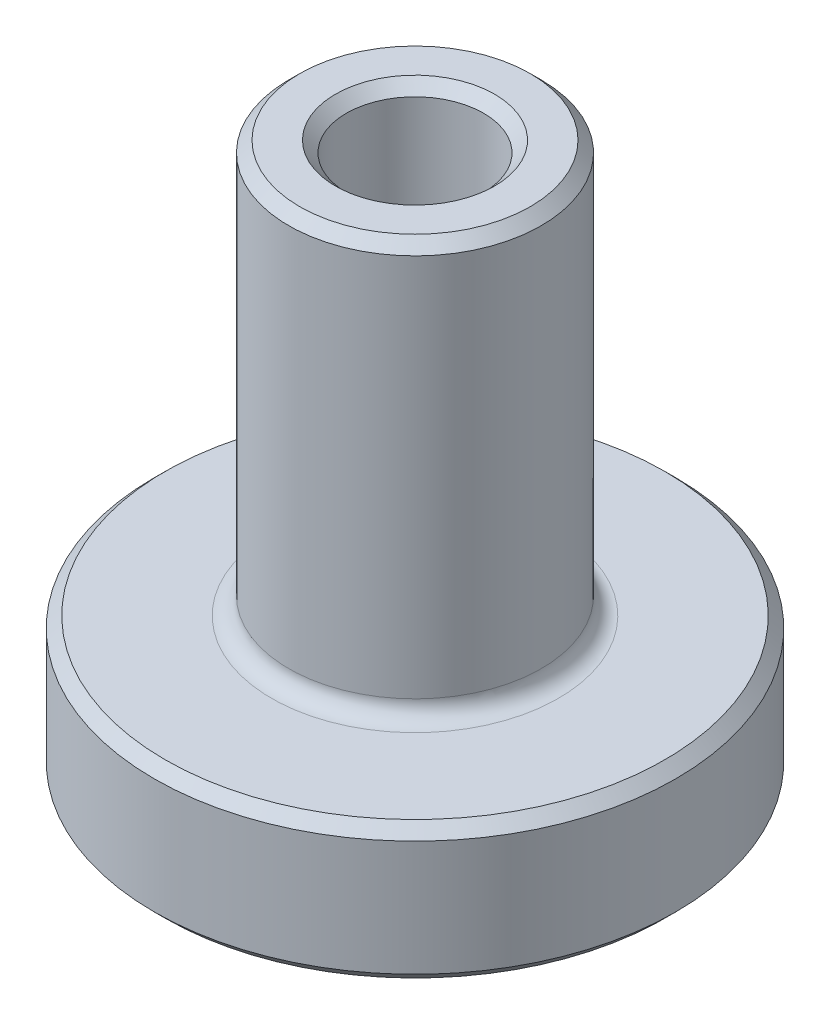
ISO-10303-21;
HEADER;
FILE_DESCRIPTION(('STEP AP214'),'2;1');
FILE_NAME('part.step','',(''),(''),'','','');
FILE_SCHEMA(('AUTOMOTIVE_DESIGN { 1 0 10303 214 1 1 1 1 }'));
ENDSEC;
DATA;
#1=APPLICATION_CONTEXT('core data for automotive mechanical design processes');
#2=APPLICATION_PROTOCOL_DEFINITION('international standard','automotive_design',2000,#1);
#3=PRODUCT_CONTEXT('',#1,'mechanical');
#4=PRODUCT('Part','Part','',(#3));
#5=PRODUCT_RELATED_PRODUCT_CATEGORY('part','',(#4));
#6=PRODUCT_DEFINITION_FORMATION('','',#4);
#7=PRODUCT_DEFINITION_CONTEXT('part definition',#1,'design');
#8=PRODUCT_DEFINITION('design','',#6,#7);
#9=PRODUCT_DEFINITION_SHAPE('','',#8);
#10=(LENGTH_UNIT() NAMED_UNIT(*) SI_UNIT(.MILLI.,.METRE.));
#11=(NAMED_UNIT(*) PLANE_ANGLE_UNIT() SI_UNIT($,.RADIAN.));
#12=(NAMED_UNIT(*) SI_UNIT($,.STERADIAN.) SOLID_ANGLE_UNIT());
#13=UNCERTAINTY_MEASURE_WITH_UNIT(LENGTH_MEASURE(1.E-05),#10,'distance_accuracy_value','');
#14=(GEOMETRIC_REPRESENTATION_CONTEXT(3) GLOBAL_UNCERTAINTY_ASSIGNED_CONTEXT((#13)) GLOBAL_UNIT_ASSIGNED_CONTEXT((#10,
#11,#12)) REPRESENTATION_CONTEXT('',''));
#15=CARTESIAN_POINT('',(0.,0.,0.));
#16=DIRECTION('',(0.,0.,1.));
#17=DIRECTION('',(1.,0.,0.));
#18=AXIS2_PLACEMENT_3D('',#15,#16,#17);
#19=CARTESIAN_POINT('',(0.,7.88649990336381,0.));
#20=DIRECTION('',(0.,1.,0.));
#21=DIRECTION('',(0.,0.,1.));
#22=AXIS2_PLACEMENT_3D('',#19,#20,#21);
#23=CYLINDRICAL_SURFACE('',#22,1.5875);
#24=CARTESIAN_POINT('',(0.,12.446,0.));
#25=DIRECTION('',(0.,-1.,0.));
#26=DIRECTION('',(0.,0.,-1.));
#27=AXIS2_PLACEMENT_3D('',#24,#25,#26);
#28=CIRCLE('',#27,1.5875);
#29=CARTESIAN_POINT('',(0.,12.446,-1.5875));
#30=VERTEX_POINT('',#29);
#31=EDGE_CURVE('E45',#30,#30,#28,.F.);
#32=ORIENTED_EDGE('',*,*,#31,.T.);
#33=EDGE_LOOP('',(#32));
#34=FACE_BOUND('',#33,.T.);
#35=CARTESIAN_POINT('',(0.,0.254000000000006,0.));
#36=DIRECTION('',(0.,1.,0.));
#37=DIRECTION('',(0.,0.,1.));
#38=AXIS2_PLACEMENT_3D('',#35,#36,#37);
#39=CIRCLE('',#38,1.5875);
#40=CARTESIAN_POINT('',(0.,0.254000000000006,1.5875));
#41=VERTEX_POINT('',#40);
#42=EDGE_CURVE('E50',#41,#41,#39,.F.);
#43=ORIENTED_EDGE('',*,*,#42,.T.);
#44=EDGE_LOOP('',(#43));
#45=FACE_BOUND('',#44,.T.);
#46=ADVANCED_FACE('F30',(#34,#45),#23,.F.);
#47=CARTESIAN_POINT('',(1.5875,0.,0.));
#48=DIRECTION('',(0.,1.,0.));
#49=DIRECTION('',(0.,0.,1.));
#50=AXIS2_PLACEMENT_3D('',#47,#48,#49);
#51=PLANE('',#50);
#52=CARTESIAN_POINT('',(0.,0.,0.));
#53=DIRECTION('',(0.,1.,0.));
#54=DIRECTION('',(0.,0.,1.));
#55=AXIS2_PLACEMENT_3D('',#52,#53,#54);
#56=CIRCLE('',#55,5.77849999999999);
#57=CARTESIAN_POINT('',(0.,0.,5.77849999999999));
#58=VERTEX_POINT('',#57);
#59=EDGE_CURVE('E56',#58,#58,#56,.F.);
#60=ORIENTED_EDGE('',*,*,#59,.T.);
#61=EDGE_LOOP('',(#60));
#62=FACE_BOUND('',#61,.T.);
#63=CARTESIAN_POINT('',(0.,0.,0.));
#64=DIRECTION('',(0.,1.,0.));
#65=DIRECTION('',(0.,0.,1.));
#66=AXIS2_PLACEMENT_3D('',#63,#64,#65);
#67=CIRCLE('',#66,1.8415);
#68=CARTESIAN_POINT('',(0.,0.,1.8415));
#69=VERTEX_POINT('',#68);
#70=EDGE_CURVE('E59',#69,#69,#67,.T.);
#71=ORIENTED_EDGE('',*,*,#70,.T.);
#72=EDGE_LOOP('',(#71));
#73=FACE_BOUND('',#72,.T.);
#74=ADVANCED_FACE('F94',(#62,#73),#51,.F.);
#75=CARTESIAN_POINT('',(0.,7.88649990336381,0.));
#76=DIRECTION('',(0.,1.,0.));
#77=DIRECTION('',(0.,0.,1.));
#78=AXIS2_PLACEMENT_3D('',#75,#76,#77);
#79=CYLINDRICAL_SURFACE('',#78,6.0325);
#80=CARTESIAN_POINT('',(0.,0.254000000000006,0.));
#81=DIRECTION('',(0.,1.,0.));
#82=DIRECTION('',(0.,0.,1.));
#83=AXIS2_PLACEMENT_3D('',#80,#81,#82);
#84=CIRCLE('',#83,6.0325);
#85=CARTESIAN_POINT('',(0.,0.254000000000006,6.0325));
#86=VERTEX_POINT('',#85);
#87=EDGE_CURVE('E62',#86,#86,#84,.T.);
#88=ORIENTED_EDGE('',*,*,#87,.T.);
#89=EDGE_LOOP('',(#88));
#90=FACE_BOUND('',#89,.T.);
#91=CARTESIAN_POINT('',(0.,2.921,0.));
#92=DIRECTION('',(0.,-1.,0.));
#93=DIRECTION('',(0.,0.,-1.));
#94=AXIS2_PLACEMENT_3D('',#91,#92,#93);
#95=CIRCLE('',#94,6.0325);
#96=CARTESIAN_POINT('',(0.,2.921,-6.0325));
#97=VERTEX_POINT('',#96);
#98=EDGE_CURVE('E65',#97,#97,#95,.T.);
#99=ORIENTED_EDGE('',*,*,#98,.T.);
#100=EDGE_LOOP('',(#99));
#101=FACE_BOUND('',#100,.T.);
#102=ADVANCED_FACE('F99',(#90,#101),#79,.T.);
#103=CARTESIAN_POINT('',(6.0325,3.175,0.));
#104=DIRECTION('',(0.,-1.,0.));
#105=DIRECTION('',(0.,0.,-1.));
#106=AXIS2_PLACEMENT_3D('',#103,#104,#105);
#107=PLANE('',#106);
#108=CARTESIAN_POINT('',(0.,3.175,0.));
#109=DIRECTION('',(0.,-1.,0.));
#110=DIRECTION('',(0.,0.,-1.));
#111=AXIS2_PLACEMENT_3D('',#108,#109,#110);
#112=CIRCLE('',#111,5.7785);
#113=CARTESIAN_POINT('',(0.,3.175,-5.7785));
#114=VERTEX_POINT('',#113);
#115=EDGE_CURVE('E53',#114,#114,#112,.F.);
#116=ORIENTED_EDGE('',*,*,#115,.T.);
#117=EDGE_LOOP('',(#116));
#118=FACE_BOUND('',#117,.T.);
#119=CARTESIAN_POINT('',(0.,3.175,0.));
#120=DIRECTION('',(0.,-1.,0.));
#121=DIRECTION('',(0.,0.,-1.));
#122=AXIS2_PLACEMENT_3D('',#119,#120,#121);
#123=CIRCLE('',#122,3.317875);
#124=CARTESIAN_POINT('',(0.,3.175,-3.317875));
#125=VERTEX_POINT('',#124);
#126=EDGE_CURVE('E68',#125,#125,#123,.T.);
#127=ORIENTED_EDGE('',*,*,#126,.T.);
#128=EDGE_LOOP('',(#127));
#129=FACE_BOUND('',#128,.T.);
#130=ADVANCED_FACE('F106',(#118,#129),#107,.F.);
#131=CARTESIAN_POINT('',(0.,7.88649990336381,0.));
#132=DIRECTION('',(0.,1.,0.));
#133=DIRECTION('',(0.,0.,1.));
#134=AXIS2_PLACEMENT_3D('',#131,#132,#133);
#135=CYLINDRICAL_SURFACE('',#134,2.921);
#136=CARTESIAN_POINT('',(0.,12.446,0.));
#137=DIRECTION('',(0.,-1.,0.));
#138=DIRECTION('',(0.,0.,-1.));
#139=AXIS2_PLACEMENT_3D('',#136,#137,#138);
#140=CIRCLE('',#139,2.921);
#141=CARTESIAN_POINT('',(0.,12.446,-2.921));
#142=VERTEX_POINT('',#141);
#143=EDGE_CURVE('E10',#142,#142,#140,.T.);
#144=ORIENTED_EDGE('',*,*,#143,.T.);
#145=EDGE_LOOP('',(#144));
#146=FACE_BOUND('',#145,.T.);
#147=CARTESIAN_POINT('',(0.,3.571875,0.));
#148=DIRECTION('',(0.,-1.,0.));
#149=DIRECTION('',(0.,0.,-1.));
#150=AXIS2_PLACEMENT_3D('',#147,#148,#149);
#151=CIRCLE('',#150,2.921);
#152=CARTESIAN_POINT('',(0.,3.571875,-2.921));
#153=VERTEX_POINT('',#152);
#154=EDGE_CURVE('E71',#153,#153,#151,.F.);
#155=ORIENTED_EDGE('',*,*,#154,.T.);
#156=EDGE_LOOP('',(#155));
#157=FACE_BOUND('',#156,.T.);
#158=ADVANCED_FACE('F75',(#146,#157),#135,.T.);
#159=CARTESIAN_POINT('',(2.921,12.7,0.));
#160=DIRECTION('',(0.,-1.,0.));
#161=DIRECTION('',(0.,0.,-1.));
#162=AXIS2_PLACEMENT_3D('',#159,#160,#161);
#163=PLANE('',#162);
#164=CARTESIAN_POINT('',(0.,12.7,0.));
#165=DIRECTION('',(0.,-1.,0.));
#166=DIRECTION('',(0.,0.,-1.));
#167=AXIS2_PLACEMENT_3D('',#164,#165,#166);
#168=CIRCLE('',#167,1.8415);
#169=CARTESIAN_POINT('',(0.,12.7,-1.8415));
#170=VERTEX_POINT('',#169);
#171=EDGE_CURVE('E37',#170,#170,#168,.T.);
#172=ORIENTED_EDGE('',*,*,#171,.T.);
#173=EDGE_LOOP('',(#172));
#174=FACE_BOUND('',#173,.T.);
#175=CARTESIAN_POINT('',(0.,12.7,0.));
#176=DIRECTION('',(0.,-1.,0.));
#177=DIRECTION('',(0.,0.,-1.));
#178=AXIS2_PLACEMENT_3D('',#175,#176,#177);
#179=CIRCLE('',#178,2.667);
#180=CARTESIAN_POINT('',(0.,12.7,-2.667));
#181=VERTEX_POINT('',#180);
#182=EDGE_CURVE('E41',#181,#181,#179,.F.);
#183=ORIENTED_EDGE('',*,*,#182,.T.);
#184=EDGE_LOOP('',(#183));
#185=FACE_BOUND('',#184,.T.);
#186=ADVANCED_FACE('F80',(#174,#185),#163,.F.);
#187=CARTESIAN_POINT('',(0.,3.571875,0.));
#188=DIRECTION('',(0.,-1.,0.));
#189=DIRECTION('',(0.,0.,-1.));
#190=AXIS2_PLACEMENT_3D('',#187,#188,#189);
#191=TOROIDAL_SURFACE('',#190,3.317875,0.396875);
#192=ORIENTED_EDGE('',*,*,#126,.F.);
#193=EDGE_LOOP('',(#192));
#194=FACE_BOUND('',#193,.T.);
#195=ORIENTED_EDGE('',*,*,#154,.F.);
#196=EDGE_LOOP('',(#195));
#197=FACE_BOUND('',#196,.T.);
#198=ADVANCED_FACE('F77',(#194,#197),#191,.F.);
#199=CARTESIAN_POINT('',(0.,0.254000000000006,0.));
#200=DIRECTION('',(0.,1.,0.));
#201=DIRECTION('',(0.,0.,1.));
#202=AXIS2_PLACEMENT_3D('',#199,#200,#201);
#203=CONICAL_SURFACE('',#202,6.0325,0.785398163397452);
#204=ORIENTED_EDGE('',*,*,#59,.F.);
#205=EDGE_LOOP('',(#204));
#206=FACE_BOUND('',#205,.T.);
#207=ORIENTED_EDGE('',*,*,#87,.F.);
#208=EDGE_LOOP('',(#207));
#209=FACE_BOUND('',#208,.T.);
#210=ADVANCED_FACE('F79',(#206,#209),#203,.T.);
#211=CARTESIAN_POINT('',(0.,3.175,0.));
#212=DIRECTION('',(0.,-1.,0.));
#213=DIRECTION('',(0.,0.,-1.));
#214=AXIS2_PLACEMENT_3D('',#211,#212,#213);
#215=CONICAL_SURFACE('',#214,5.7785,0.785398163397445);
#216=ORIENTED_EDGE('',*,*,#98,.F.);
#217=EDGE_LOOP('',(#216));
#218=FACE_BOUND('',#217,.T.);
#219=ORIENTED_EDGE('',*,*,#115,.F.);
#220=EDGE_LOOP('',(#219));
#221=FACE_BOUND('',#220,.T.);
#222=ADVANCED_FACE('F87',(#218,#221),#215,.T.);
#223=CARTESIAN_POINT('',(0.,12.446,0.));
#224=DIRECTION('',(0.,1.,0.));
#225=DIRECTION('',(0.,0.,1.));
#226=AXIS2_PLACEMENT_3D('',#223,#224,#225);
#227=CONICAL_SURFACE('',#226,1.5875,0.785398163397446);
#228=ORIENTED_EDGE('',*,*,#171,.F.);
#229=EDGE_LOOP('',(#228));
#230=FACE_BOUND('',#229,.T.);
#231=ORIENTED_EDGE('',*,*,#31,.F.);
#232=EDGE_LOOP('',(#231));
#233=FACE_BOUND('',#232,.T.);
#234=ADVANCED_FACE('F136',(#230,#233),#227,.F.);
#235=CARTESIAN_POINT('',(0.,0.,0.));
#236=DIRECTION('',(0.,-1.,0.));
#237=DIRECTION('',(0.,0.,-1.));
#238=AXIS2_PLACEMENT_3D('',#235,#236,#237);
#239=CONICAL_SURFACE('',#238,1.8415,0.785398163397446);
#240=ORIENTED_EDGE('',*,*,#42,.F.);
#241=EDGE_LOOP('',(#240));
#242=FACE_BOUND('',#241,.T.);
#243=ORIENTED_EDGE('',*,*,#70,.F.);
#244=EDGE_LOOP('',(#243));
#245=FACE_BOUND('',#244,.T.);
#246=ADVANCED_FACE('F146',(#242,#245),#239,.F.);
#247=CARTESIAN_POINT('',(0.,12.7,0.));
#248=DIRECTION('',(0.,-1.,0.));
#249=DIRECTION('',(0.,0.,-1.));
#250=AXIS2_PLACEMENT_3D('',#247,#248,#249);
#251=CONICAL_SURFACE('',#250,2.667,0.785398163397447);
#252=ORIENTED_EDGE('',*,*,#143,.F.);
#253=EDGE_LOOP('',(#252));
#254=FACE_BOUND('',#253,.T.);
#255=ORIENTED_EDGE('',*,*,#182,.F.);
#256=EDGE_LOOP('',(#255));
#257=FACE_BOUND('',#256,.T.);
#258=ADVANCED_FACE('F32',(#254,#257),#251,.T.);
#259=CLOSED_SHELL('',(#46,#74,#102,#130,#158,#186,#198,#210,#222,#234,#246,#258));
#260=MANIFOLD_SOLID_BREP('B2',#259);
#261=ADVANCED_BREP_SHAPE_REPRESENTATION('',(#18,#260),#14);
#262=SHAPE_DEFINITION_REPRESENTATION(#9,#261);
ENDSEC;
END-ISO-10303-21;
